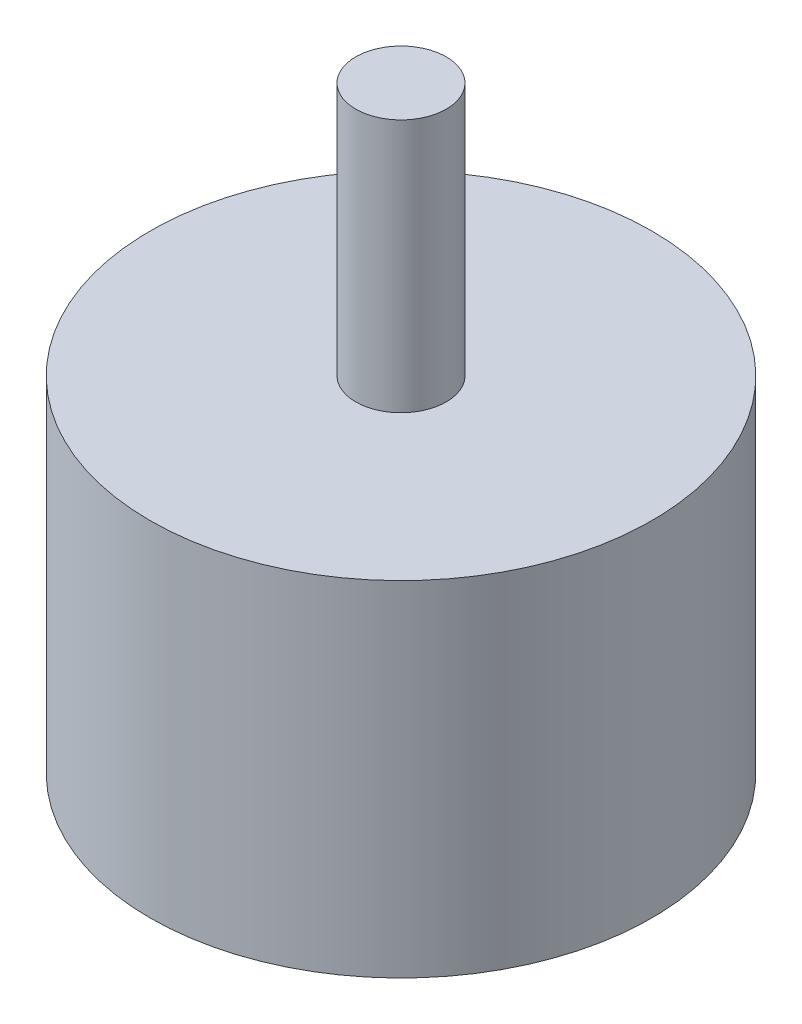
ISO-10303-21;
HEADER;
FILE_DESCRIPTION(('STEP AP214'),'2;1');
FILE_NAME('part.step','',(''),(''),'','','');
FILE_SCHEMA(('AUTOMOTIVE_DESIGN { 1 0 10303 214 1 1 1 1 }'));
ENDSEC;
DATA;
#1=APPLICATION_CONTEXT('core data for automotive mechanical design processes');
#2=APPLICATION_PROTOCOL_DEFINITION('international standard','automotive_design',2000,#1);
#3=PRODUCT_CONTEXT('',#1,'mechanical');
#4=PRODUCT('Part','Part','',(#3));
#5=PRODUCT_RELATED_PRODUCT_CATEGORY('part','',(#4));
#6=PRODUCT_DEFINITION_FORMATION('','',#4);
#7=PRODUCT_DEFINITION_CONTEXT('part definition',#1,'design');
#8=PRODUCT_DEFINITION('design','',#6,#7);
#9=PRODUCT_DEFINITION_SHAPE('','',#8);
#10=(LENGTH_UNIT() NAMED_UNIT(*) SI_UNIT(.MILLI.,.METRE.));
#11=(NAMED_UNIT(*) PLANE_ANGLE_UNIT() SI_UNIT($,.RADIAN.));
#12=(NAMED_UNIT(*) SI_UNIT($,.STERADIAN.) SOLID_ANGLE_UNIT());
#13=UNCERTAINTY_MEASURE_WITH_UNIT(LENGTH_MEASURE(1.E-05),#10,'distance_accuracy_value','');
#14=(GEOMETRIC_REPRESENTATION_CONTEXT(3) GLOBAL_UNCERTAINTY_ASSIGNED_CONTEXT((#13)) GLOBAL_UNIT_ASSIGNED_CONTEXT((#10,
#11,#12)) REPRESENTATION_CONTEXT('',''));
#15=CARTESIAN_POINT('',(0.,0.,0.));
#16=DIRECTION('',(0.,0.,1.));
#17=DIRECTION('',(1.,0.,0.));
#18=AXIS2_PLACEMENT_3D('',#15,#16,#17);
#19=CARTESIAN_POINT('',(0.,19.,0.));
#20=DIRECTION('',(0.,-1.,0.));
#21=DIRECTION('',(0.,0.,-1.));
#22=AXIS2_PLACEMENT_3D('',#19,#20,#21);
#23=CYLINDRICAL_SURFACE('',#22,13.85);
#24=CARTESIAN_POINT('',(0.,19.,0.));
#25=DIRECTION('',(0.,1.,0.));
#26=DIRECTION('',(0.,0.,1.));
#27=AXIS2_PLACEMENT_3D('',#24,#25,#26);
#28=CIRCLE('',#27,13.85);
#29=CARTESIAN_POINT('',(0.,19.,13.85));
#30=VERTEX_POINT('',#29);
#31=EDGE_CURVE('E11',#30,#30,#28,.T.);
#32=ORIENTED_EDGE('',*,*,#31,.F.);
#33=EDGE_LOOP('',(#32));
#34=FACE_BOUND('',#33,.T.);
#35=CARTESIAN_POINT('',(0.,0.,0.));
#36=DIRECTION('',(0.,1.,0.));
#37=DIRECTION('',(0.,0.,1.));
#38=AXIS2_PLACEMENT_3D('',#35,#36,#37);
#39=CIRCLE('',#38,13.85);
#40=CARTESIAN_POINT('',(0.,0.,13.85));
#41=VERTEX_POINT('',#40);
#42=EDGE_CURVE('E41',#41,#41,#39,.T.);
#43=ORIENTED_EDGE('',*,*,#42,.T.);
#44=EDGE_LOOP('',(#43));
#45=FACE_BOUND('',#44,.T.);
#46=ADVANCED_FACE('F38',(#34,#45),#23,.T.);
#47=CARTESIAN_POINT('',(0.,19.,0.));
#48=DIRECTION('',(0.,1.,0.));
#49=DIRECTION('',(0.,0.,1.));
#50=AXIS2_PLACEMENT_3D('',#47,#48,#49);
#51=PLANE('',#50);
#52=CARTESIAN_POINT('',(0.,19.,0.));
#53=DIRECTION('',(0.,1.,0.));
#54=DIRECTION('',(0.,0.,1.));
#55=AXIS2_PLACEMENT_3D('',#52,#53,#54);
#56=CIRCLE('',#55,2.5);
#57=CARTESIAN_POINT('',(0.,19.,2.5));
#58=VERTEX_POINT('',#57);
#59=EDGE_CURVE('E91',#58,#58,#56,.T.);
#60=ORIENTED_EDGE('',*,*,#59,.F.);
#61=EDGE_LOOP('',(#60));
#62=FACE_BOUND('',#61,.T.);
#63=ORIENTED_EDGE('',*,*,#31,.T.);
#64=EDGE_LOOP('',(#63));
#65=FACE_BOUND('',#64,.T.);
#66=ADVANCED_FACE('F100',(#62,#65),#51,.T.);
#67=CARTESIAN_POINT('',(0.,0.,0.));
#68=DIRECTION('',(0.,1.,0.));
#69=DIRECTION('',(0.,0.,1.));
#70=AXIS2_PLACEMENT_3D('',#67,#68,#69);
#71=PLANE('',#70);
#72=CARTESIAN_POINT('',(0.,0.,8.));
#73=DIRECTION('',(0.,-1.,0.));
#74=DIRECTION('',(0.,0.,-1.));
#75=AXIS2_PLACEMENT_3D('',#72,#73,#74);
#76=CIRCLE('',#75,1.24999999999999);
#77=CARTESIAN_POINT('',(0.,0.,6.75000000000001));
#78=VERTEX_POINT('',#77);
#79=EDGE_CURVE('E69',#78,#78,#76,.T.);
#80=ORIENTED_EDGE('',*,*,#79,.F.);
#81=EDGE_LOOP('',(#80));
#82=FACE_BOUND('',#81,.T.);
#83=CARTESIAN_POINT('',(-9.5,0.,0.));
#84=DIRECTION('',(0.,-1.,0.));
#85=DIRECTION('',(0.,0.,-1.));
#86=AXIS2_PLACEMENT_3D('',#83,#84,#85);
#87=CIRCLE('',#86,1.24999999999999);
#88=CARTESIAN_POINT('',(-9.5,0.,-1.24999999999999));
#89=VERTEX_POINT('',#88);
#90=EDGE_CURVE('E68',#89,#89,#87,.T.);
#91=ORIENTED_EDGE('',*,*,#90,.F.);
#92=EDGE_LOOP('',(#91));
#93=FACE_BOUND('',#92,.T.);
#94=CARTESIAN_POINT('',(0.,0.,-8.));
#95=DIRECTION('',(0.,-1.,0.));
#96=DIRECTION('',(0.,0.,-1.));
#97=AXIS2_PLACEMENT_3D('',#94,#95,#96);
#98=CIRCLE('',#97,1.24999999999999);
#99=CARTESIAN_POINT('',(0.,0.,-9.24999999999999));
#100=VERTEX_POINT('',#99);
#101=EDGE_CURVE('E79',#100,#100,#98,.T.);
#102=ORIENTED_EDGE('',*,*,#101,.F.);
#103=EDGE_LOOP('',(#102));
#104=FACE_BOUND('',#103,.T.);
#105=CARTESIAN_POINT('',(9.5,0.,0.));
#106=DIRECTION('',(0.,-1.,0.));
#107=DIRECTION('',(0.,0.,-1.));
#108=AXIS2_PLACEMENT_3D('',#105,#106,#107);
#109=CIRCLE('',#108,1.24999999999999);
#110=CARTESIAN_POINT('',(9.5,0.,-1.24999999999999));
#111=VERTEX_POINT('',#110);
#112=EDGE_CURVE('E85',#111,#111,#109,.T.);
#113=ORIENTED_EDGE('',*,*,#112,.F.);
#114=EDGE_LOOP('',(#113));
#115=FACE_BOUND('',#114,.T.);
#116=ORIENTED_EDGE('',*,*,#42,.F.);
#117=EDGE_LOOP('',(#116));
#118=FACE_BOUND('',#117,.T.);
#119=ADVANCED_FACE('F103',(#82,#93,#104,#115,#118),#71,.F.);
#120=CARTESIAN_POINT('',(0.,33.,0.));
#121=DIRECTION('',(0.,-1.,0.));
#122=DIRECTION('',(0.,0.,-1.));
#123=AXIS2_PLACEMENT_3D('',#120,#121,#122);
#124=CYLINDRICAL_SURFACE('',#123,2.5);
#125=CARTESIAN_POINT('',(0.,33.,0.));
#126=DIRECTION('',(0.,1.,0.));
#127=DIRECTION('',(0.,0.,1.));
#128=AXIS2_PLACEMENT_3D('',#125,#126,#127);
#129=CIRCLE('',#128,2.5);
#130=CARTESIAN_POINT('',(0.,33.,2.5));
#131=VERTEX_POINT('',#130);
#132=EDGE_CURVE('E92',#131,#131,#129,.T.);
#133=ORIENTED_EDGE('',*,*,#132,.F.);
#134=EDGE_LOOP('',(#133));
#135=FACE_BOUND('',#134,.T.);
#136=ORIENTED_EDGE('',*,*,#59,.T.);
#137=EDGE_LOOP('',(#136));
#138=FACE_BOUND('',#137,.T.);
#139=ADVANCED_FACE('F98',(#135,#138),#124,.T.);
#140=CARTESIAN_POINT('',(0.,33.,0.));
#141=DIRECTION('',(0.,1.,0.));
#142=DIRECTION('',(0.,0.,1.));
#143=AXIS2_PLACEMENT_3D('',#140,#141,#142);
#144=PLANE('',#143);
#145=ORIENTED_EDGE('',*,*,#132,.T.);
#146=EDGE_LOOP('',(#145));
#147=FACE_BOUND('',#146,.T.);
#148=ADVANCED_FACE('F117',(#147),#144,.T.);
#149=CARTESIAN_POINT('',(9.5,7.50000000000001,0.));
#150=DIRECTION('',(0.,-1.,0.));
#151=DIRECTION('',(0.,0.,-1.));
#152=AXIS2_PLACEMENT_3D('',#149,#150,#151);
#153=CONICAL_SURFACE('',#152,1.24999999999999,1.02974425867665);
#154=CARTESIAN_POINT('',(9.5,8.25107577378445,0.));
#155=VERTEX_POINT('',#154);
#156=VERTEX_LOOP('',#155);
#157=FACE_BOUND('',#156,.T.);
#158=CARTESIAN_POINT('',(9.5,7.50000000000001,0.));
#159=DIRECTION('',(0.,-1.,0.));
#160=DIRECTION('',(0.,0.,-1.));
#161=AXIS2_PLACEMENT_3D('',#158,#159,#160);
#162=CIRCLE('',#161,1.24999999999999);
#163=CARTESIAN_POINT('',(9.5,7.50000000000001,-1.24999999999999));
#164=VERTEX_POINT('',#163);
#165=EDGE_CURVE('E88',#164,#164,#162,.T.);
#166=ORIENTED_EDGE('',*,*,#165,.T.);
#167=EDGE_LOOP('',(#166));
#168=FACE_BOUND('',#167,.T.);
#169=ADVANCED_FACE('F125',(#157,#168),#153,.F.);
#170=CARTESIAN_POINT('',(9.5,0.,0.));
#171=DIRECTION('',(0.,-1.,0.));
#172=DIRECTION('',(0.,0.,-1.));
#173=AXIS2_PLACEMENT_3D('',#170,#171,#172);
#174=CYLINDRICAL_SURFACE('',#173,1.24999999999999);
#175=ORIENTED_EDGE('',*,*,#165,.F.);
#176=EDGE_LOOP('',(#175));
#177=FACE_BOUND('',#176,.T.);
#178=ORIENTED_EDGE('',*,*,#112,.T.);
#179=EDGE_LOOP('',(#178));
#180=FACE_BOUND('',#179,.T.);
#181=ADVANCED_FACE('F129',(#177,#180),#174,.F.);
#182=CARTESIAN_POINT('',(0.,7.50000000000001,-8.));
#183=DIRECTION('',(0.,-1.,0.));
#184=DIRECTION('',(0.,0.,-1.));
#185=AXIS2_PLACEMENT_3D('',#182,#183,#184);
#186=CONICAL_SURFACE('',#185,1.24999999999999,1.02974425867665);
#187=CARTESIAN_POINT('',(0.,8.25107577378445,-8.));
#188=VERTEX_POINT('',#187);
#189=VERTEX_LOOP('',#188);
#190=FACE_BOUND('',#189,.T.);
#191=CARTESIAN_POINT('',(0.,7.50000000000001,-8.));
#192=DIRECTION('',(0.,-1.,0.));
#193=DIRECTION('',(0.,0.,-1.));
#194=AXIS2_PLACEMENT_3D('',#191,#192,#193);
#195=CIRCLE('',#194,1.24999999999999);
#196=CARTESIAN_POINT('',(0.,7.50000000000001,-9.24999999999999));
#197=VERTEX_POINT('',#196);
#198=EDGE_CURVE('E82',#197,#197,#195,.T.);
#199=ORIENTED_EDGE('',*,*,#198,.T.);
#200=EDGE_LOOP('',(#199));
#201=FACE_BOUND('',#200,.T.);
#202=ADVANCED_FACE('F132',(#190,#201),#186,.F.);
#203=CARTESIAN_POINT('',(0.,0.,-8.));
#204=DIRECTION('',(0.,-1.,0.));
#205=DIRECTION('',(0.,0.,-1.));
#206=AXIS2_PLACEMENT_3D('',#203,#204,#205);
#207=CYLINDRICAL_SURFACE('',#206,1.24999999999999);
#208=ORIENTED_EDGE('',*,*,#198,.F.);
#209=EDGE_LOOP('',(#208));
#210=FACE_BOUND('',#209,.T.);
#211=ORIENTED_EDGE('',*,*,#101,.T.);
#212=EDGE_LOOP('',(#211));
#213=FACE_BOUND('',#212,.T.);
#214=ADVANCED_FACE('F136',(#210,#213),#207,.F.);
#215=CARTESIAN_POINT('',(-9.5,7.50000000000001,0.));
#216=DIRECTION('',(0.,-1.,0.));
#217=DIRECTION('',(0.,0.,-1.));
#218=AXIS2_PLACEMENT_3D('',#215,#216,#217);
#219=CONICAL_SURFACE('',#218,1.24999999999999,1.02974425867665);
#220=CARTESIAN_POINT('',(-9.5,8.25107577378445,0.));
#221=VERTEX_POINT('',#220);
#222=VERTEX_LOOP('',#221);
#223=FACE_BOUND('',#222,.T.);
#224=CARTESIAN_POINT('',(-9.5,7.50000000000001,0.));
#225=DIRECTION('',(0.,-1.,0.));
#226=DIRECTION('',(0.,0.,-1.));
#227=AXIS2_PLACEMENT_3D('',#224,#225,#226);
#228=CIRCLE('',#227,1.24999999999999);
#229=CARTESIAN_POINT('',(-9.5,7.50000000000001,-1.24999999999999));
#230=VERTEX_POINT('',#229);
#231=EDGE_CURVE('E72',#230,#230,#228,.T.);
#232=ORIENTED_EDGE('',*,*,#231,.T.);
#233=EDGE_LOOP('',(#232));
#234=FACE_BOUND('',#233,.T.);
#235=ADVANCED_FACE('F139',(#223,#234),#219,.F.);
#236=CARTESIAN_POINT('',(-9.5,0.,0.));
#237=DIRECTION('',(0.,-1.,0.));
#238=DIRECTION('',(0.,0.,-1.));
#239=AXIS2_PLACEMENT_3D('',#236,#237,#238);
#240=CYLINDRICAL_SURFACE('',#239,1.24999999999999);
#241=ORIENTED_EDGE('',*,*,#231,.F.);
#242=EDGE_LOOP('',(#241));
#243=FACE_BOUND('',#242,.T.);
#244=ORIENTED_EDGE('',*,*,#90,.T.);
#245=EDGE_LOOP('',(#244));
#246=FACE_BOUND('',#245,.T.);
#247=ADVANCED_FACE('F62',(#243,#246),#240,.F.);
#248=CARTESIAN_POINT('',(0.,7.50000000000001,8.));
#249=DIRECTION('',(0.,-1.,0.));
#250=DIRECTION('',(0.,0.,-1.));
#251=AXIS2_PLACEMENT_3D('',#248,#249,#250);
#252=CONICAL_SURFACE('',#251,1.24999999999999,1.02974425867665);
#253=CARTESIAN_POINT('',(0.,8.25107577378445,8.));
#254=VERTEX_POINT('',#253);
#255=VERTEX_LOOP('',#254);
#256=FACE_BOUND('',#255,.T.);
#257=CARTESIAN_POINT('',(0.,7.50000000000001,8.));
#258=DIRECTION('',(0.,-1.,0.));
#259=DIRECTION('',(0.,0.,-1.));
#260=AXIS2_PLACEMENT_3D('',#257,#258,#259);
#261=CIRCLE('',#260,1.24999999999999);
#262=CARTESIAN_POINT('',(0.,7.50000000000001,6.75000000000001));
#263=VERTEX_POINT('',#262);
#264=EDGE_CURVE('E66',#263,#263,#261,.T.);
#265=ORIENTED_EDGE('',*,*,#264,.T.);
#266=EDGE_LOOP('',(#265));
#267=FACE_BOUND('',#266,.T.);
#268=ADVANCED_FACE('F58',(#256,#267),#252,.F.);
#269=CARTESIAN_POINT('',(0.,0.,8.));
#270=DIRECTION('',(0.,-1.,0.));
#271=DIRECTION('',(0.,0.,-1.));
#272=AXIS2_PLACEMENT_3D('',#269,#270,#271);
#273=CYLINDRICAL_SURFACE('',#272,1.24999999999999);
#274=ORIENTED_EDGE('',*,*,#264,.F.);
#275=EDGE_LOOP('',(#274));
#276=FACE_BOUND('',#275,.T.);
#277=ORIENTED_EDGE('',*,*,#79,.T.);
#278=EDGE_LOOP('',(#277));
#279=FACE_BOUND('',#278,.T.);
#280=ADVANCED_FACE('F61',(#276,#279),#273,.F.);
#281=CLOSED_SHELL('',(#46,#66,#119,#139,#148,#169,#181,#202,#214,#235,#247,#268,#280));
#282=MANIFOLD_SOLID_BREP('B2',#281);
#283=ADVANCED_BREP_SHAPE_REPRESENTATION('',(#18,#282),#14);
#284=SHAPE_DEFINITION_REPRESENTATION(#9,#283);
ENDSEC;
END-ISO-10303-21;
